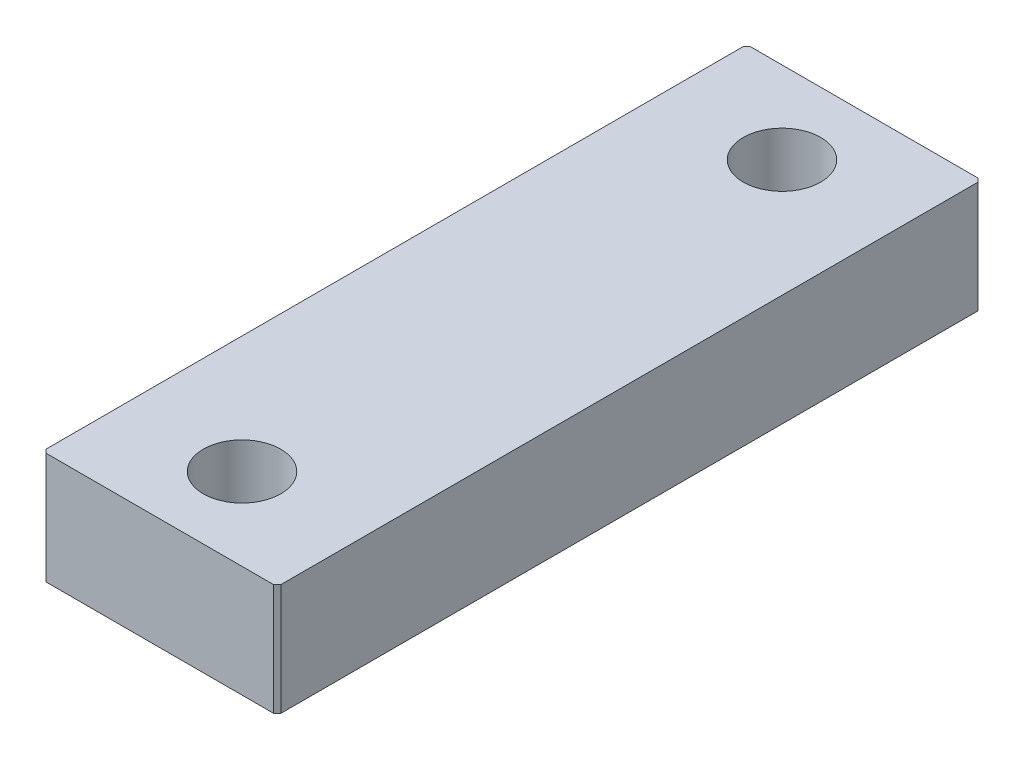
ISO-10303-21;
HEADER;
FILE_DESCRIPTION(('STEP AP214'),'2;1');
FILE_NAME('part.step','',(''),(''),'','','');
FILE_SCHEMA(('AUTOMOTIVE_DESIGN { 1 0 10303 214 1 1 1 1 }'));
ENDSEC;
DATA;
#1=APPLICATION_CONTEXT('core data for automotive mechanical design processes');
#2=APPLICATION_PROTOCOL_DEFINITION('international standard','automotive_design',2000,#1);
#3=PRODUCT_CONTEXT('',#1,'mechanical');
#4=PRODUCT('Part','Part','',(#3));
#5=PRODUCT_RELATED_PRODUCT_CATEGORY('part','',(#4));
#6=PRODUCT_DEFINITION_FORMATION('','',#4);
#7=PRODUCT_DEFINITION_CONTEXT('part definition',#1,'design');
#8=PRODUCT_DEFINITION('design','',#6,#7);
#9=PRODUCT_DEFINITION_SHAPE('','',#8);
#10=(LENGTH_UNIT() NAMED_UNIT(*) SI_UNIT(.MILLI.,.METRE.));
#11=(NAMED_UNIT(*) PLANE_ANGLE_UNIT() SI_UNIT($,.RADIAN.));
#12=(NAMED_UNIT(*) SI_UNIT($,.STERADIAN.) SOLID_ANGLE_UNIT());
#13=UNCERTAINTY_MEASURE_WITH_UNIT(LENGTH_MEASURE(1.E-05),#10,'distance_accuracy_value','');
#14=(GEOMETRIC_REPRESENTATION_CONTEXT(3) GLOBAL_UNCERTAINTY_ASSIGNED_CONTEXT((#13)) GLOBAL_UNIT_ASSIGNED_CONTEXT((#10,
#11,#12)) REPRESENTATION_CONTEXT('',''));
#15=CARTESIAN_POINT('',(0.,0.,0.));
#16=DIRECTION('',(0.,0.,1.));
#17=DIRECTION('',(1.,0.,0.));
#18=AXIS2_PLACEMENT_3D('',#15,#16,#17);
#19=CARTESIAN_POINT('',(0.,9.5,0.));
#20=DIRECTION('',(0.,-1.,0.));
#21=DIRECTION('',(0.,0.,-1.));
#22=AXIS2_PLACEMENT_3D('',#19,#20,#21);
#23=PLANE('',#22);
#24=DIRECTION('',(0.,0.,-1.));
#25=VECTOR('',#24,1.);
#26=CARTESIAN_POINT('',(10.,9.5,-30.));
#27=LINE('',#26,#25);
#28=CARTESIAN_POINT('',(10.,9.5,29.7));
#29=VERTEX_POINT('',#28);
#30=CARTESIAN_POINT('',(10.,9.5,-29.7));
#31=VERTEX_POINT('',#30);
#32=EDGE_CURVE('E184',#29,#31,#27,.T.);
#33=ORIENTED_EDGE('',*,*,#32,.T.);
#34=DIRECTION('',(0.707106781186548,0.,0.707106781186548));
#35=VECTOR('',#34,1.);
#36=CARTESIAN_POINT('',(9.7,9.5,-30.));
#37=LINE('',#36,#35);
#38=CARTESIAN_POINT('',(9.7,9.5,-30.));
#39=VERTEX_POINT('',#38);
#40=EDGE_CURVE('E172',#31,#39,#37,.F.);
#41=ORIENTED_EDGE('',*,*,#40,.T.);
#42=DIRECTION('',(-1.,0.,0.));
#43=VECTOR('',#42,1.);
#44=CARTESIAN_POINT('',(10.,9.5,-30.));
#45=LINE('',#44,#43);
#46=CARTESIAN_POINT('',(-9.7,9.5,-30.));
#47=VERTEX_POINT('',#46);
#48=EDGE_CURVE('E130',#39,#47,#45,.T.);
#49=ORIENTED_EDGE('',*,*,#48,.T.);
#50=DIRECTION('',(0.707106781186548,0.,-0.707106781186548));
#51=VECTOR('',#50,1.);
#52=CARTESIAN_POINT('',(-10.,9.5,-29.7));
#53=LINE('',#52,#51);
#54=CARTESIAN_POINT('',(-10.,9.5,-29.7));
#55=VERTEX_POINT('',#54);
#56=EDGE_CURVE('E169',#47,#55,#53,.F.);
#57=ORIENTED_EDGE('',*,*,#56,.T.);
#58=DIRECTION('',(0.,0.,1.));
#59=VECTOR('',#58,1.);
#60=CARTESIAN_POINT('',(-10.,9.5,-30.));
#61=LINE('',#60,#59);
#62=CARTESIAN_POINT('',(-9.99999999999999,9.5,29.7));
#63=VERTEX_POINT('',#62);
#64=EDGE_CURVE('E139',#55,#63,#61,.T.);
#65=ORIENTED_EDGE('',*,*,#64,.T.);
#66=DIRECTION('',(-0.707106781186546,0.,-0.70710678118655));
#67=VECTOR('',#66,1.);
#68=CARTESIAN_POINT('',(-9.69999999999999,9.5,30.));
#69=LINE('',#68,#67);
#70=CARTESIAN_POINT('',(-9.69999999999999,9.5,30.));
#71=VERTEX_POINT('',#70);
#72=EDGE_CURVE('E64',#63,#71,#69,.F.);
#73=ORIENTED_EDGE('',*,*,#72,.T.);
#74=DIRECTION('',(1.,0.,0.));
#75=VECTOR('',#74,1.);
#76=CARTESIAN_POINT('',(10.,9.5,30.));
#77=LINE('',#76,#75);
#78=CARTESIAN_POINT('',(9.70000000000002,9.5,30.));
#79=VERTEX_POINT('',#78);
#80=EDGE_CURVE('E144',#71,#79,#77,.T.);
#81=ORIENTED_EDGE('',*,*,#80,.T.);
#82=DIRECTION('',(-0.707106781186535,0.,0.70710678118656));
#83=VECTOR('',#82,1.);
#84=CARTESIAN_POINT('',(10.,9.5,29.7));
#85=LINE('',#84,#83);
#86=EDGE_CURVE('E164',#79,#29,#85,.F.);
#87=ORIENTED_EDGE('',*,*,#86,.T.);
#88=EDGE_LOOP('',(#33,#41,#49,#57,#65,#73,#81,#87));
#89=FACE_BOUND('',#88,.T.);
#90=CARTESIAN_POINT('',(0.,9.5,-23.));
#91=DIRECTION('',(0.,1.,0.));
#92=DIRECTION('',(0.,0.,1.));
#93=AXIS2_PLACEMENT_3D('',#90,#91,#92);
#94=CIRCLE('',#93,3.3);
#95=CARTESIAN_POINT('',(0.,9.5,-19.7));
#96=VERTEX_POINT('',#95);
#97=EDGE_CURVE('E196',#96,#96,#94,.T.);
#98=ORIENTED_EDGE('',*,*,#97,.F.);
#99=EDGE_LOOP('',(#98));
#100=FACE_BOUND('',#99,.T.);
#101=CARTESIAN_POINT('',(0.,9.5,23.));
#102=DIRECTION('',(0.,1.,0.));
#103=DIRECTION('',(0.,0.,1.));
#104=AXIS2_PLACEMENT_3D('',#101,#102,#103);
#105=CIRCLE('',#104,3.3);
#106=CARTESIAN_POINT('',(0.,9.5,26.3));
#107=VERTEX_POINT('',#106);
#108=EDGE_CURVE('E239',#107,#107,#105,.T.);
#109=ORIENTED_EDGE('',*,*,#108,.F.);
#110=EDGE_LOOP('',(#109));
#111=FACE_BOUND('',#110,.T.);
#112=ADVANCED_FACE('F41',(#89,#100,#111),#23,.F.);
#113=CARTESIAN_POINT('',(0.,0.,0.));
#114=DIRECTION('',(0.,-1.,0.));
#115=DIRECTION('',(0.,0.,-1.));
#116=AXIS2_PLACEMENT_3D('',#113,#114,#115);
#117=PLANE('',#116);
#118=CARTESIAN_POINT('',(0.,0.,-23.));
#119=DIRECTION('',(0.,1.,0.));
#120=DIRECTION('',(0.,0.,1.));
#121=AXIS2_PLACEMENT_3D('',#118,#119,#120);
#122=CIRCLE('',#121,3.3);
#123=CARTESIAN_POINT('',(0.,0.,-19.7));
#124=VERTEX_POINT('',#123);
#125=EDGE_CURVE('E246',#124,#124,#122,.T.);
#126=ORIENTED_EDGE('',*,*,#125,.T.);
#127=EDGE_LOOP('',(#126));
#128=FACE_BOUND('',#127,.T.);
#129=DIRECTION('',(-1.,0.,0.));
#130=VECTOR('',#129,1.);
#131=CARTESIAN_POINT('',(10.,0.,-30.));
#132=LINE('',#131,#130);
#133=CARTESIAN_POINT('',(9.7,0.,-30.));
#134=VERTEX_POINT('',#133);
#135=CARTESIAN_POINT('',(-9.7,0.,-30.));
#136=VERTEX_POINT('',#135);
#137=EDGE_CURVE('E127',#134,#136,#132,.T.);
#138=ORIENTED_EDGE('',*,*,#137,.F.);
#139=DIRECTION('',(-0.707106781186548,0.,-0.707106781186548));
#140=VECTOR('',#139,1.);
#141=CARTESIAN_POINT('',(19.85,0.,-19.85));
#142=LINE('',#141,#140);
#143=CARTESIAN_POINT('',(10.,0.,-29.7));
#144=VERTEX_POINT('',#143);
#145=EDGE_CURVE('E109',#134,#144,#142,.F.);
#146=ORIENTED_EDGE('',*,*,#145,.T.);
#147=DIRECTION('',(0.,0.,-1.));
#148=VECTOR('',#147,1.);
#149=CARTESIAN_POINT('',(10.,0.,-30.));
#150=LINE('',#149,#148);
#151=CARTESIAN_POINT('',(10.,0.,29.7));
#152=VERTEX_POINT('',#151);
#153=EDGE_CURVE('E140',#152,#144,#150,.T.);
#154=ORIENTED_EDGE('',*,*,#153,.F.);
#155=DIRECTION('',(0.707106781186535,0.,-0.70710678118656));
#156=VECTOR('',#155,1.);
#157=CARTESIAN_POINT('',(19.8500000000002,0.,19.8499999999995));
#158=LINE('',#157,#156);
#159=CARTESIAN_POINT('',(9.70000000000002,0.,30.));
#160=VERTEX_POINT('',#159);
#161=EDGE_CURVE('E132',#152,#160,#158,.F.);
#162=ORIENTED_EDGE('',*,*,#161,.T.);
#163=DIRECTION('',(1.,0.,0.));
#164=VECTOR('',#163,1.);
#165=CARTESIAN_POINT('',(10.,0.,30.));
#166=LINE('',#165,#164);
#167=CARTESIAN_POINT('',(-9.69999999999999,0.,30.));
#168=VERTEX_POINT('',#167);
#169=EDGE_CURVE('E146',#168,#160,#166,.T.);
#170=ORIENTED_EDGE('',*,*,#169,.F.);
#171=DIRECTION('',(0.707106781186546,0.,0.70710678118655));
#172=VECTOR('',#171,1.);
#173=CARTESIAN_POINT('',(-19.85,0.,19.8499999999999));
#174=LINE('',#173,#172);
#175=CARTESIAN_POINT('',(-9.99999999999999,0.,29.7));
#176=VERTEX_POINT('',#175);
#177=EDGE_CURVE('E154',#168,#176,#174,.F.);
#178=ORIENTED_EDGE('',*,*,#177,.T.);
#179=DIRECTION('',(0.,0.,1.));
#180=VECTOR('',#179,1.);
#181=CARTESIAN_POINT('',(-10.,0.,-30.));
#182=LINE('',#181,#180);
#183=CARTESIAN_POINT('',(-10.,0.,-29.7));
#184=VERTEX_POINT('',#183);
#185=EDGE_CURVE('E193',#184,#176,#182,.T.);
#186=ORIENTED_EDGE('',*,*,#185,.F.);
#187=DIRECTION('',(-0.707106781186548,0.,0.707106781186548));
#188=VECTOR('',#187,1.);
#189=CARTESIAN_POINT('',(-19.85,0.,-19.85));
#190=LINE('',#189,#188);
#191=EDGE_CURVE('E121',#184,#136,#190,.F.);
#192=ORIENTED_EDGE('',*,*,#191,.T.);
#193=EDGE_LOOP('',(#138,#146,#154,#162,#170,#178,#186,#192));
#194=FACE_BOUND('',#193,.T.);
#195=CARTESIAN_POINT('',(0.,0.,23.));
#196=DIRECTION('',(0.,1.,0.));
#197=DIRECTION('',(0.,0.,1.));
#198=AXIS2_PLACEMENT_3D('',#195,#196,#197);
#199=CIRCLE('',#198,3.3);
#200=CARTESIAN_POINT('',(0.,0.,26.3));
#201=VERTEX_POINT('',#200);
#202=EDGE_CURVE('E242',#201,#201,#199,.T.);
#203=ORIENTED_EDGE('',*,*,#202,.T.);
#204=EDGE_LOOP('',(#203));
#205=FACE_BOUND('',#204,.T.);
#206=ADVANCED_FACE('F135',(#128,#194,#205),#117,.T.);
#207=CARTESIAN_POINT('',(-10.,9.5,-30.));
#208=DIRECTION('',(1.,0.,0.));
#209=DIRECTION('',(0.,0.,-1.));
#210=AXIS2_PLACEMENT_3D('',#207,#208,#209);
#211=PLANE('',#210);
#212=ORIENTED_EDGE('',*,*,#64,.F.);
#213=DIRECTION('',(0.,-1.,0.));
#214=VECTOR('',#213,1.);
#215=CARTESIAN_POINT('',(-10.,9.5,-29.7));
#216=LINE('',#215,#214);
#217=EDGE_CURVE('E178',#55,#184,#216,.T.);
#218=ORIENTED_EDGE('',*,*,#217,.T.);
#219=ORIENTED_EDGE('',*,*,#185,.T.);
#220=DIRECTION('',(0.,1.,0.));
#221=VECTOR('',#220,1.);
#222=CARTESIAN_POINT('',(-9.99999999999999,9.5,29.7));
#223=LINE('',#222,#221);
#224=EDGE_CURVE('E175',#176,#63,#223,.T.);
#225=ORIENTED_EDGE('',*,*,#224,.T.);
#226=EDGE_LOOP('',(#212,#218,#219,#225));
#227=FACE_BOUND('',#226,.T.);
#228=ADVANCED_FACE('F215',(#227),#211,.F.);
#229=CARTESIAN_POINT('',(10.,9.5,30.));
#230=DIRECTION('',(0.,0.,-1.));
#231=DIRECTION('',(-1.,0.,0.));
#232=AXIS2_PLACEMENT_3D('',#229,#230,#231);
#233=PLANE('',#232);
#234=ORIENTED_EDGE('',*,*,#80,.F.);
#235=DIRECTION('',(0.,-1.,0.));
#236=VECTOR('',#235,1.);
#237=CARTESIAN_POINT('',(-9.69999999999999,9.5,30.));
#238=LINE('',#237,#236);
#239=EDGE_CURVE('E11',#71,#168,#238,.T.);
#240=ORIENTED_EDGE('',*,*,#239,.T.);
#241=ORIENTED_EDGE('',*,*,#169,.T.);
#242=DIRECTION('',(0.,1.,0.));
#243=VECTOR('',#242,1.);
#244=CARTESIAN_POINT('',(9.70000000000002,9.5,30.));
#245=LINE('',#244,#243);
#246=EDGE_CURVE('E51',#160,#79,#245,.T.);
#247=ORIENTED_EDGE('',*,*,#246,.T.);
#248=EDGE_LOOP('',(#234,#240,#241,#247));
#249=FACE_BOUND('',#248,.T.);
#250=ADVANCED_FACE('F199',(#249),#233,.F.);
#251=CARTESIAN_POINT('',(10.,9.5,-30.));
#252=DIRECTION('',(-1.,0.,0.));
#253=DIRECTION('',(0.,0.,1.));
#254=AXIS2_PLACEMENT_3D('',#251,#252,#253);
#255=PLANE('',#254);
#256=ORIENTED_EDGE('',*,*,#153,.T.);
#257=DIRECTION('',(0.,1.,0.));
#258=VECTOR('',#257,1.);
#259=CARTESIAN_POINT('',(10.,9.5,-29.7));
#260=LINE('',#259,#258);
#261=EDGE_CURVE('E114',#144,#31,#260,.T.);
#262=ORIENTED_EDGE('',*,*,#261,.T.);
#263=ORIENTED_EDGE('',*,*,#32,.F.);
#264=DIRECTION('',(0.,-1.,0.));
#265=VECTOR('',#264,1.);
#266=CARTESIAN_POINT('',(10.,9.5,29.7));
#267=LINE('',#266,#265);
#268=EDGE_CURVE('E120',#29,#152,#267,.T.);
#269=ORIENTED_EDGE('',*,*,#268,.T.);
#270=EDGE_LOOP('',(#256,#262,#263,#269));
#271=FACE_BOUND('',#270,.T.);
#272=ADVANCED_FACE('F206',(#271),#255,.F.);
#273=CARTESIAN_POINT('',(10.,9.5,-30.));
#274=DIRECTION('',(0.,0.,1.));
#275=DIRECTION('',(1.,0.,0.));
#276=AXIS2_PLACEMENT_3D('',#273,#274,#275);
#277=PLANE('',#276);
#278=ORIENTED_EDGE('',*,*,#48,.F.);
#279=DIRECTION('',(0.,-1.,0.));
#280=VECTOR('',#279,1.);
#281=CARTESIAN_POINT('',(9.7,9.5,-30.));
#282=LINE('',#281,#280);
#283=EDGE_CURVE('E113',#39,#134,#282,.T.);
#284=ORIENTED_EDGE('',*,*,#283,.T.);
#285=ORIENTED_EDGE('',*,*,#137,.T.);
#286=DIRECTION('',(0.,1.,0.));
#287=VECTOR('',#286,1.);
#288=CARTESIAN_POINT('',(-9.7,9.5,-30.));
#289=LINE('',#288,#287);
#290=EDGE_CURVE('E133',#136,#47,#289,.T.);
#291=ORIENTED_EDGE('',*,*,#290,.T.);
#292=EDGE_LOOP('',(#278,#284,#285,#291));
#293=FACE_BOUND('',#292,.T.);
#294=ADVANCED_FACE('F126',(#293),#277,.F.);
#295=CARTESIAN_POINT('',(0.,9.5,-23.));
#296=DIRECTION('',(0.,-1.,0.));
#297=DIRECTION('',(0.,0.,-1.));
#298=AXIS2_PLACEMENT_3D('',#295,#296,#297);
#299=CYLINDRICAL_SURFACE('',#298,3.3);
#300=ORIENTED_EDGE('',*,*,#97,.T.);
#301=EDGE_LOOP('',(#300));
#302=FACE_BOUND('',#301,.T.);
#303=ORIENTED_EDGE('',*,*,#125,.F.);
#304=EDGE_LOOP('',(#303));
#305=FACE_BOUND('',#304,.T.);
#306=ADVANCED_FACE('F213',(#302,#305),#299,.F.);
#307=CARTESIAN_POINT('',(0.,9.5,23.));
#308=DIRECTION('',(0.,-1.,0.));
#309=DIRECTION('',(0.,0.,-1.));
#310=AXIS2_PLACEMENT_3D('',#307,#308,#309);
#311=CYLINDRICAL_SURFACE('',#310,3.3);
#312=ORIENTED_EDGE('',*,*,#108,.T.);
#313=EDGE_LOOP('',(#312));
#314=FACE_BOUND('',#313,.T.);
#315=ORIENTED_EDGE('',*,*,#202,.F.);
#316=EDGE_LOOP('',(#315));
#317=FACE_BOUND('',#316,.T.);
#318=ADVANCED_FACE('F227',(#314,#317),#311,.F.);
#319=CARTESIAN_POINT('',(9.7,9.5,-30.));
#320=DIRECTION('',(-0.707106781186548,0.,0.707106781186548));
#321=DIRECTION('',(0.,-1.,0.));
#322=AXIS2_PLACEMENT_3D('',#319,#320,#321);
#323=PLANE('',#322);
#324=ORIENTED_EDGE('',*,*,#40,.F.);
#325=ORIENTED_EDGE('',*,*,#261,.F.);
#326=ORIENTED_EDGE('',*,*,#145,.F.);
#327=ORIENTED_EDGE('',*,*,#283,.F.);
#328=EDGE_LOOP('',(#324,#325,#326,#327));
#329=FACE_BOUND('',#328,.T.);
#330=ADVANCED_FACE('F112',(#329),#323,.F.);
#331=CARTESIAN_POINT('',(-10.,9.5,-29.7));
#332=DIRECTION('',(0.707106781186548,0.,0.707106781186548));
#333=DIRECTION('',(0.,-1.,0.));
#334=AXIS2_PLACEMENT_3D('',#331,#332,#333);
#335=PLANE('',#334);
#336=ORIENTED_EDGE('',*,*,#56,.F.);
#337=ORIENTED_EDGE('',*,*,#290,.F.);
#338=ORIENTED_EDGE('',*,*,#191,.F.);
#339=ORIENTED_EDGE('',*,*,#217,.F.);
#340=EDGE_LOOP('',(#336,#337,#338,#339));
#341=FACE_BOUND('',#340,.T.);
#342=ADVANCED_FACE('F234',(#341),#335,.F.);
#343=CARTESIAN_POINT('',(-9.69999999999999,9.5,30.));
#344=DIRECTION('',(0.70710678118655,0.,-0.707106781186546));
#345=DIRECTION('',(0.,-1.,0.));
#346=AXIS2_PLACEMENT_3D('',#343,#344,#345);
#347=PLANE('',#346);
#348=ORIENTED_EDGE('',*,*,#72,.F.);
#349=ORIENTED_EDGE('',*,*,#224,.F.);
#350=ORIENTED_EDGE('',*,*,#177,.F.);
#351=ORIENTED_EDGE('',*,*,#239,.F.);
#352=EDGE_LOOP('',(#348,#349,#350,#351));
#353=FACE_BOUND('',#352,.T.);
#354=ADVANCED_FACE('F260',(#353),#347,.F.);
#355=CARTESIAN_POINT('',(10.,9.5,29.7));
#356=DIRECTION('',(-0.70710678118656,0.,-0.707106781186535));
#357=DIRECTION('',(0.,-1.,0.));
#358=AXIS2_PLACEMENT_3D('',#355,#356,#357);
#359=PLANE('',#358);
#360=ORIENTED_EDGE('',*,*,#86,.F.);
#361=ORIENTED_EDGE('',*,*,#246,.F.);
#362=ORIENTED_EDGE('',*,*,#161,.F.);
#363=ORIENTED_EDGE('',*,*,#268,.F.);
#364=EDGE_LOOP('',(#360,#361,#362,#363));
#365=FACE_BOUND('',#364,.T.);
#366=ADVANCED_FACE('F44',(#365),#359,.F.);
#367=CLOSED_SHELL('',(#112,#206,#228,#250,#272,#294,#306,#318,#330,#342,#354,#366));
#368=MANIFOLD_SOLID_BREP('B2',#367);
#369=ADVANCED_BREP_SHAPE_REPRESENTATION('',(#18,#368),#14);
#370=SHAPE_DEFINITION_REPRESENTATION(#9,#369);
ENDSEC;
END-ISO-10303-21;
